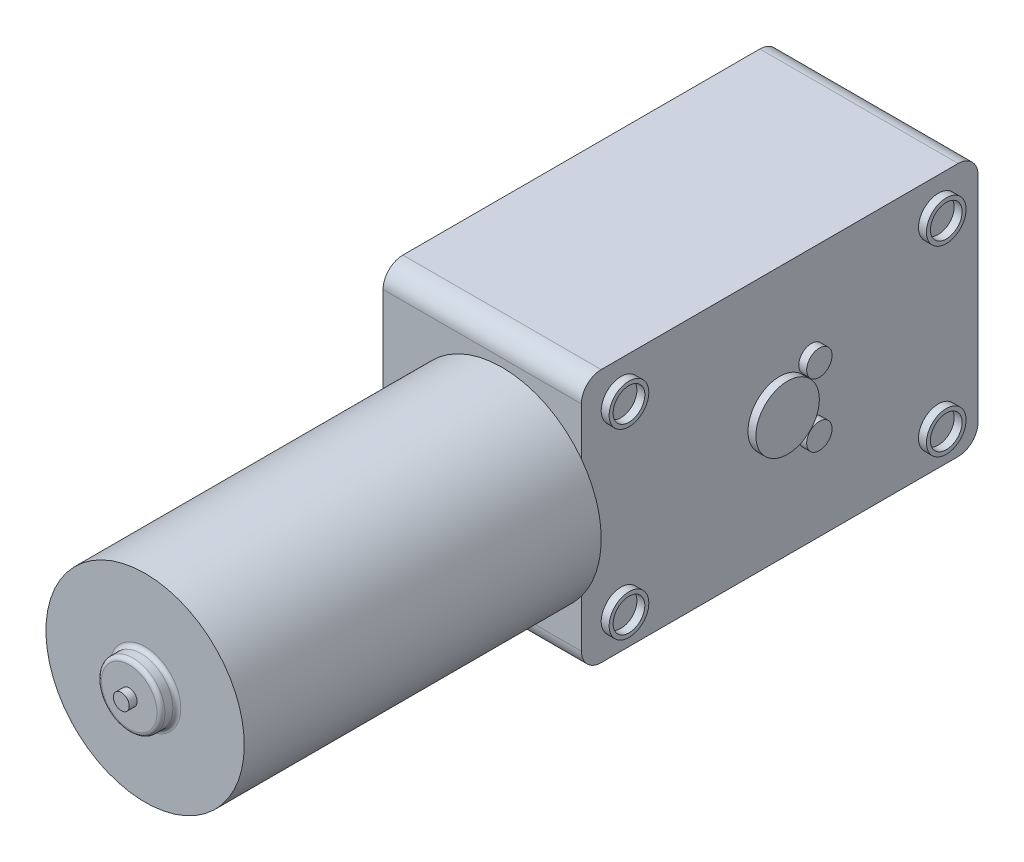
ISO-10303-21;
HEADER;
FILE_DESCRIPTION(('STEP AP214'),'2;1');
FILE_NAME('part.step','',(''),(''),'','','');
FILE_SCHEMA(('AUTOMOTIVE_DESIGN { 1 0 10303 214 1 1 1 1 }'));
ENDSEC;
DATA;
#1=APPLICATION_CONTEXT('core data for automotive mechanical design processes');
#2=APPLICATION_PROTOCOL_DEFINITION('international standard','automotive_design',2000,#1);
#3=PRODUCT_CONTEXT('',#1,'mechanical');
#4=PRODUCT('Part','Part','',(#3));
#5=PRODUCT_RELATED_PRODUCT_CATEGORY('part','',(#4));
#6=PRODUCT_DEFINITION_FORMATION('','',#4);
#7=PRODUCT_DEFINITION_CONTEXT('part definition',#1,'design');
#8=PRODUCT_DEFINITION('design','',#6,#7);
#9=PRODUCT_DEFINITION_SHAPE('','',#8);
#10=(LENGTH_UNIT() NAMED_UNIT(*) SI_UNIT(.MILLI.,.METRE.));
#11=(NAMED_UNIT(*) PLANE_ANGLE_UNIT() SI_UNIT($,.RADIAN.));
#12=(NAMED_UNIT(*) SI_UNIT($,.STERADIAN.) SOLID_ANGLE_UNIT());
#13=UNCERTAINTY_MEASURE_WITH_UNIT(LENGTH_MEASURE(1.E-05),#10,'distance_accuracy_value','');
#14=(GEOMETRIC_REPRESENTATION_CONTEXT(3) GLOBAL_UNCERTAINTY_ASSIGNED_CONTEXT((#13)) GLOBAL_UNIT_ASSIGNED_CONTEXT((#10,
#11,#12)) REPRESENTATION_CONTEXT('',''));
#15=CARTESIAN_POINT('',(0.,0.,0.));
#16=DIRECTION('',(0.,0.,1.));
#17=DIRECTION('',(1.,0.,0.));
#18=AXIS2_PLACEMENT_3D('',#15,#16,#17);
#19=CARTESIAN_POINT('',(108.969208633094,23.3,53.));
#20=DIRECTION('',(0.,0.,-1.));
#21=DIRECTION('',(-1.,0.,0.));
#22=AXIS2_PLACEMENT_3D('',#19,#20,#21);
#23=PLANE('',#22);
#24=CARTESIAN_POINT('',(98.9692086330936,7.29999999999999,53.));
#25=DIRECTION('',(0.,0.,1.));
#26=DIRECTION('',(1.,0.,0.));
#27=AXIS2_PLACEMENT_3D('',#24,#25,#26);
#28=CIRCLE('',#27,12.5);
#29=CARTESIAN_POINT('',(108.969208633094,14.8,53.));
#30=VERTEX_POINT('',#29);
#31=CARTESIAN_POINT('',(108.969208633094,-0.200000000000002,53.));
#32=VERTEX_POINT('',#31);
#33=EDGE_CURVE('E60',#30,#32,#28,.T.);
#34=ORIENTED_EDGE('',*,*,#33,.F.);
#35=DIRECTION('',(0.,-1.,0.));
#36=VECTOR('',#35,1.);
#37=CARTESIAN_POINT('',(108.969208633094,23.3,53.));
#38=LINE('',#37,#36);
#39=CARTESIAN_POINT('',(108.969208633094,20.8,53.));
#40=VERTEX_POINT('',#39);
#41=EDGE_CURVE('E125',#40,#30,#38,.T.);
#42=ORIENTED_EDGE('',*,*,#41,.F.);
#43=DIRECTION('',(-1.,0.,0.));
#44=VECTOR('',#43,1.);
#45=CARTESIAN_POINT('',(108.969208633094,20.8,53.));
#46=LINE('',#45,#44);
#47=CARTESIAN_POINT('',(83.9692086330936,20.8,53.));
#48=VERTEX_POINT('',#47);
#49=EDGE_CURVE('E173',#40,#48,#46,.T.);
#50=ORIENTED_EDGE('',*,*,#49,.T.);
#51=DIRECTION('',(0.,-1.,0.));
#52=VECTOR('',#51,1.);
#53=CARTESIAN_POINT('',(83.9692086330936,23.3,53.));
#54=LINE('',#53,#52);
#55=CARTESIAN_POINT('',(83.9692086330936,-6.20000000000001,53.));
#56=VERTEX_POINT('',#55);
#57=EDGE_CURVE('E309',#48,#56,#54,.T.);
#58=ORIENTED_EDGE('',*,*,#57,.T.);
#59=DIRECTION('',(-1.,0.,0.));
#60=VECTOR('',#59,1.);
#61=CARTESIAN_POINT('',(108.969208633094,-6.20000000000001,53.));
#62=LINE('',#61,#60);
#63=CARTESIAN_POINT('',(108.969208633094,-6.20000000000001,53.));
#64=VERTEX_POINT('',#63);
#65=EDGE_CURVE('E171',#56,#64,#62,.F.);
#66=ORIENTED_EDGE('',*,*,#65,.T.);
#67=EDGE_CURVE('E126',#32,#64,#38,.T.);
#68=ORIENTED_EDGE('',*,*,#67,.F.);
#69=EDGE_LOOP('',(#34,#42,#50,#58,#66,#68));
#70=FACE_BOUND('',#69,.T.);
#71=ADVANCED_FACE('F46',(#70),#23,.F.);
#72=CARTESIAN_POINT('',(108.969208633094,-8.70000000000001,53.));
#73=DIRECTION('',(0.,1.,0.));
#74=DIRECTION('',(0.,0.,1.));
#75=AXIS2_PLACEMENT_3D('',#72,#73,#74);
#76=PLANE('',#75);
#77=DIRECTION('',(0.,0.,-1.));
#78=VECTOR('',#77,1.);
#79=CARTESIAN_POINT('',(83.9692086330936,-8.70000000000001,53.));
#80=LINE('',#79,#78);
#81=CARTESIAN_POINT('',(83.9692086330936,-8.70000000000001,50.5));
#82=VERTEX_POINT('',#81);
#83=CARTESIAN_POINT('',(83.9692086330936,-8.70000000000001,5.50000000000001));
#84=VERTEX_POINT('',#83);
#85=EDGE_CURVE('E154',#82,#84,#80,.T.);
#86=ORIENTED_EDGE('',*,*,#85,.T.);
#87=DIRECTION('',(-1.,0.,0.));
#88=VECTOR('',#87,1.);
#89=CARTESIAN_POINT('',(108.969208633094,-8.70000000000001,5.50000000000001));
#90=LINE('',#89,#88);
#91=CARTESIAN_POINT('',(108.969208633094,-8.70000000000001,5.50000000000001));
#92=VERTEX_POINT('',#91);
#93=EDGE_CURVE('E201',#84,#92,#90,.F.);
#94=ORIENTED_EDGE('',*,*,#93,.T.);
#95=DIRECTION('',(0.,0.,-1.));
#96=VECTOR('',#95,1.);
#97=CARTESIAN_POINT('',(108.969208633094,-8.70000000000001,53.));
#98=LINE('',#97,#96);
#99=CARTESIAN_POINT('',(108.969208633094,-8.70000000000001,50.5));
#100=VERTEX_POINT('',#99);
#101=EDGE_CURVE('E141',#100,#92,#98,.T.);
#102=ORIENTED_EDGE('',*,*,#101,.F.);
#103=DIRECTION('',(-1.,0.,0.));
#104=VECTOR('',#103,1.);
#105=CARTESIAN_POINT('',(108.969208633094,-8.70000000000001,50.5));
#106=LINE('',#105,#104);
#107=EDGE_CURVE('E198',#100,#82,#106,.T.);
#108=ORIENTED_EDGE('',*,*,#107,.T.);
#109=EDGE_LOOP('',(#86,#94,#102,#108));
#110=FACE_BOUND('',#109,.T.);
#111=ADVANCED_FACE('F342',(#110),#76,.F.);
#112=CARTESIAN_POINT('',(108.969208633094,23.3,3.));
#113=DIRECTION('',(0.,0.,1.));
#114=DIRECTION('',(0.,-1.,0.));
#115=AXIS2_PLACEMENT_3D('',#112,#113,#114);
#116=PLANE('',#115);
#117=DIRECTION('',(0.,1.,0.));
#118=VECTOR('',#117,1.);
#119=CARTESIAN_POINT('',(83.9692086330936,23.3,3.));
#120=LINE('',#119,#118);
#121=CARTESIAN_POINT('',(83.9692086330936,-6.20000000000001,3.));
#122=VERTEX_POINT('',#121);
#123=CARTESIAN_POINT('',(83.9692086330936,20.8,3.));
#124=VERTEX_POINT('',#123);
#125=EDGE_CURVE('E148',#122,#124,#120,.T.);
#126=ORIENTED_EDGE('',*,*,#125,.T.);
#127=DIRECTION('',(-1.,0.,0.));
#128=VECTOR('',#127,1.);
#129=CARTESIAN_POINT('',(108.969208633094,20.8,3.));
#130=LINE('',#129,#128);
#131=CARTESIAN_POINT('',(108.969208633094,20.8,3.));
#132=VERTEX_POINT('',#131);
#133=EDGE_CURVE('E68',#124,#132,#130,.F.);
#134=ORIENTED_EDGE('',*,*,#133,.T.);
#135=DIRECTION('',(0.,1.,0.));
#136=VECTOR('',#135,1.);
#137=CARTESIAN_POINT('',(108.969208633094,23.3,3.));
#138=LINE('',#137,#136);
#139=CARTESIAN_POINT('',(108.969208633094,-6.20000000000001,3.));
#140=VERTEX_POINT('',#139);
#141=EDGE_CURVE('E143',#140,#132,#138,.T.);
#142=ORIENTED_EDGE('',*,*,#141,.F.);
#143=DIRECTION('',(-1.,0.,0.));
#144=VECTOR('',#143,1.);
#145=CARTESIAN_POINT('',(108.969208633094,-6.20000000000001,3.));
#146=LINE('',#145,#144);
#147=EDGE_CURVE('E194',#140,#122,#146,.T.);
#148=ORIENTED_EDGE('',*,*,#147,.T.);
#149=EDGE_LOOP('',(#126,#134,#142,#148));
#150=FACE_BOUND('',#149,.T.);
#151=ADVANCED_FACE('F337',(#150),#116,.F.);
#152=CARTESIAN_POINT('',(108.969208633094,23.3,53.));
#153=DIRECTION('',(0.,-1.,0.));
#154=DIRECTION('',(0.,0.,-1.));
#155=AXIS2_PLACEMENT_3D('',#152,#153,#154);
#156=PLANE('',#155);
#157=DIRECTION('',(0.,0.,1.));
#158=VECTOR('',#157,1.);
#159=CARTESIAN_POINT('',(83.9692086330936,23.3,53.));
#160=LINE('',#159,#158);
#161=CARTESIAN_POINT('',(83.9692086330936,23.3,5.50000000000001));
#162=VERTEX_POINT('',#161);
#163=CARTESIAN_POINT('',(83.9692086330936,23.3,50.5));
#164=VERTEX_POINT('',#163);
#165=EDGE_CURVE('E146',#162,#164,#160,.T.);
#166=ORIENTED_EDGE('',*,*,#165,.T.);
#167=DIRECTION('',(-1.,0.,0.));
#168=VECTOR('',#167,1.);
#169=CARTESIAN_POINT('',(108.969208633094,23.3,50.5));
#170=LINE('',#169,#168);
#171=CARTESIAN_POINT('',(108.969208633094,23.3,50.5));
#172=VERTEX_POINT('',#171);
#173=EDGE_CURVE('E185',#164,#172,#170,.F.);
#174=ORIENTED_EDGE('',*,*,#173,.T.);
#175=DIRECTION('',(0.,0.,1.));
#176=VECTOR('',#175,1.);
#177=CARTESIAN_POINT('',(108.969208633094,23.3,53.));
#178=LINE('',#177,#176);
#179=CARTESIAN_POINT('',(108.969208633094,23.3,5.50000000000001));
#180=VERTEX_POINT('',#179);
#181=EDGE_CURVE('E162',#180,#172,#178,.T.);
#182=ORIENTED_EDGE('',*,*,#181,.F.);
#183=DIRECTION('',(-1.,0.,0.));
#184=VECTOR('',#183,1.);
#185=CARTESIAN_POINT('',(108.969208633094,23.3,5.50000000000001));
#186=LINE('',#185,#184);
#187=EDGE_CURVE('E183',#180,#162,#186,.T.);
#188=ORIENTED_EDGE('',*,*,#187,.T.);
#189=EDGE_LOOP('',(#166,#174,#182,#188));
#190=FACE_BOUND('',#189,.T.);
#191=ADVANCED_FACE('F335',(#190),#156,.F.);
#192=CARTESIAN_POINT('',(108.969208633094,0.,0.));
#193=DIRECTION('',(1.,0.,0.));
#194=DIRECTION('',(0.,0.,-1.));
#195=AXIS2_PLACEMENT_3D('',#192,#193,#194);
#196=PLANE('',#195);
#197=CARTESIAN_POINT('',(108.969208633094,3.29999999999999,24.));
#198=DIRECTION('',(1.,0.,0.));
#199=DIRECTION('',(0.,0.,-1.));
#200=AXIS2_PLACEMENT_3D('',#197,#198,#199);
#201=CIRCLE('',#200,1.6);
#202=CARTESIAN_POINT('',(108.969208633094,3.29999999999999,22.4));
#203=VERTEX_POINT('',#202);
#204=EDGE_CURVE('E233',#203,#203,#201,.T.);
#205=ORIENTED_EDGE('',*,*,#204,.F.);
#206=EDGE_LOOP('',(#205));
#207=FACE_BOUND('',#206,.T.);
#208=CARTESIAN_POINT('',(108.969208633094,11.3,24.));
#209=DIRECTION('',(1.,0.,0.));
#210=DIRECTION('',(0.,0.,-1.));
#211=AXIS2_PLACEMENT_3D('',#208,#209,#210);
#212=CIRCLE('',#211,1.6);
#213=CARTESIAN_POINT('',(108.969208633094,11.3,22.4));
#214=VERTEX_POINT('',#213);
#215=EDGE_CURVE('E238',#214,#214,#212,.T.);
#216=ORIENTED_EDGE('',*,*,#215,.F.);
#217=EDGE_LOOP('',(#216));
#218=FACE_BOUND('',#217,.T.);
#219=CARTESIAN_POINT('',(108.969208633094,7.29999999999999,28.));
#220=DIRECTION('',(1.,0.,0.));
#221=DIRECTION('',(0.,0.,-1.));
#222=AXIS2_PLACEMENT_3D('',#219,#220,#221);
#223=CIRCLE('',#222,4.);
#224=CARTESIAN_POINT('',(108.969208633094,7.29999999999999,24.));
#225=VERTEX_POINT('',#224);
#226=EDGE_CURVE('E244',#225,#225,#223,.T.);
#227=ORIENTED_EDGE('',*,*,#226,.F.);
#228=EDGE_LOOP('',(#227));
#229=FACE_BOUND('',#228,.T.);
#230=CARTESIAN_POINT('',(108.969208633094,-4.19999999999999,48.));
#231=DIRECTION('',(1.,0.,0.));
#232=DIRECTION('',(0.,0.,-1.));
#233=AXIS2_PLACEMENT_3D('',#230,#231,#232);
#234=CIRCLE('',#233,2.49999999999999);
#235=CARTESIAN_POINT('',(108.969208633094,-4.19999999999999,45.5));
#236=VERTEX_POINT('',#235);
#237=EDGE_CURVE('E255',#236,#236,#234,.T.);
#238=ORIENTED_EDGE('',*,*,#237,.F.);
#239=EDGE_LOOP('',(#238));
#240=FACE_BOUND('',#239,.T.);
#241=CARTESIAN_POINT('',(108.969208633094,18.8,8.00000000000001));
#242=DIRECTION('',(1.,0.,0.));
#243=DIRECTION('',(0.,0.,-1.));
#244=AXIS2_PLACEMENT_3D('',#241,#242,#243);
#245=CIRCLE('',#244,2.49999999999999);
#246=CARTESIAN_POINT('',(108.969208633094,18.8,5.50000000000002));
#247=VERTEX_POINT('',#246);
#248=EDGE_CURVE('E264',#247,#247,#245,.T.);
#249=ORIENTED_EDGE('',*,*,#248,.F.);
#250=EDGE_LOOP('',(#249));
#251=FACE_BOUND('',#250,.T.);
#252=CARTESIAN_POINT('',(108.969208633094,-4.19999999999999,8.00000000000001));
#253=DIRECTION('',(1.,0.,0.));
#254=DIRECTION('',(0.,0.,-1.));
#255=AXIS2_PLACEMENT_3D('',#252,#253,#254);
#256=CIRCLE('',#255,2.49999999999999);
#257=CARTESIAN_POINT('',(108.969208633094,-4.19999999999999,5.50000000000002));
#258=VERTEX_POINT('',#257);
#259=EDGE_CURVE('E273',#258,#258,#256,.T.);
#260=ORIENTED_EDGE('',*,*,#259,.F.);
#261=EDGE_LOOP('',(#260));
#262=FACE_BOUND('',#261,.T.);
#263=CARTESIAN_POINT('',(108.969208633094,18.8,48.));
#264=DIRECTION('',(1.,0.,0.));
#265=DIRECTION('',(0.,0.,-1.));
#266=AXIS2_PLACEMENT_3D('',#263,#264,#265);
#267=CIRCLE('',#266,2.49999999999999);
#268=CARTESIAN_POINT('',(108.969208633094,18.8,45.5));
#269=VERTEX_POINT('',#268);
#270=EDGE_CURVE('E282',#269,#269,#267,.T.);
#271=ORIENTED_EDGE('',*,*,#270,.F.);
#272=EDGE_LOOP('',(#271));
#273=FACE_BOUND('',#272,.T.);
#274=ORIENTED_EDGE('',*,*,#181,.T.);
#275=CARTESIAN_POINT('',(108.969208633094,20.8,50.5));
#276=DIRECTION('',(1.,0.,0.));
#277=DIRECTION('',(0.,0.,-1.));
#278=AXIS2_PLACEMENT_3D('',#275,#276,#277);
#279=CIRCLE('',#278,2.5);
#280=EDGE_CURVE('E140',#172,#40,#279,.T.);
#281=ORIENTED_EDGE('',*,*,#280,.T.);
#282=ORIENTED_EDGE('',*,*,#41,.T.);
#283=EDGE_CURVE('E119',#30,#32,#38,.T.);
#284=ORIENTED_EDGE('',*,*,#283,.T.);
#285=ORIENTED_EDGE('',*,*,#67,.T.);
#286=CARTESIAN_POINT('',(108.969208633094,-6.20000000000001,50.5));
#287=DIRECTION('',(1.,0.,0.));
#288=DIRECTION('',(0.,0.,-1.));
#289=AXIS2_PLACEMENT_3D('',#286,#287,#288);
#290=CIRCLE('',#289,2.5);
#291=EDGE_CURVE('E187',#64,#100,#290,.T.);
#292=ORIENTED_EDGE('',*,*,#291,.T.);
#293=ORIENTED_EDGE('',*,*,#101,.T.);
#294=CARTESIAN_POINT('',(108.969208633094,-6.20000000000001,5.5));
#295=DIRECTION('',(1.,0.,0.));
#296=DIRECTION('',(0.,0.,-1.));
#297=AXIS2_PLACEMENT_3D('',#294,#295,#296);
#298=CIRCLE('',#297,2.5);
#299=EDGE_CURVE('E189',#92,#140,#298,.T.);
#300=ORIENTED_EDGE('',*,*,#299,.T.);
#301=ORIENTED_EDGE('',*,*,#141,.T.);
#302=CARTESIAN_POINT('',(108.969208633094,20.8,5.50000000000001));
#303=DIRECTION('',(1.,0.,0.));
#304=DIRECTION('',(0.,0.,-1.));
#305=AXIS2_PLACEMENT_3D('',#302,#303,#304);
#306=CIRCLE('',#305,2.5);
#307=EDGE_CURVE('E191',#132,#180,#306,.T.);
#308=ORIENTED_EDGE('',*,*,#307,.T.);
#309=EDGE_LOOP('',(#274,#281,#282,#284,#285,#292,#293,#300,#301,#308));
#310=FACE_BOUND('',#309,.T.);
#311=ADVANCED_FACE('F138',(#207,#218,#229,#240,#251,#262,#273,#310),#196,.T.);
#312=CARTESIAN_POINT('',(83.9692086330936,0.,0.));
#313=DIRECTION('',(1.,0.,0.));
#314=DIRECTION('',(0.,0.,-1.));
#315=AXIS2_PLACEMENT_3D('',#312,#313,#314);
#316=PLANE('',#315);
#317=CARTESIAN_POINT('',(83.9692086330936,-4.20000000000001,8.00000000000001));
#318=DIRECTION('',(-1.,0.,0.));
#319=DIRECTION('',(0.,0.,1.));
#320=AXIS2_PLACEMENT_3D('',#317,#318,#319);
#321=CIRCLE('',#320,2.);
#322=CARTESIAN_POINT('',(83.9692086330936,-4.20000000000001,10.));
#323=VERTEX_POINT('',#322);
#324=EDGE_CURVE('E286',#323,#323,#321,.T.);
#325=ORIENTED_EDGE('',*,*,#324,.F.);
#326=EDGE_LOOP('',(#325));
#327=FACE_BOUND('',#326,.T.);
#328=CARTESIAN_POINT('',(83.9692086330936,-4.20000000000001,48.));
#329=DIRECTION('',(-1.,0.,0.));
#330=DIRECTION('',(0.,0.,1.));
#331=AXIS2_PLACEMENT_3D('',#328,#329,#330);
#332=CIRCLE('',#331,2.);
#333=CARTESIAN_POINT('',(83.9692086330936,-4.20000000000001,50.));
#334=VERTEX_POINT('',#333);
#335=EDGE_CURVE('E299',#334,#334,#332,.T.);
#336=ORIENTED_EDGE('',*,*,#335,.F.);
#337=EDGE_LOOP('',(#336));
#338=FACE_BOUND('',#337,.T.);
#339=CARTESIAN_POINT('',(83.9692086330936,18.8,48.));
#340=DIRECTION('',(-1.,0.,0.));
#341=DIRECTION('',(0.,0.,1.));
#342=AXIS2_PLACEMENT_3D('',#339,#340,#341);
#343=CIRCLE('',#342,2.);
#344=CARTESIAN_POINT('',(83.9692086330936,18.8,50.));
#345=VERTEX_POINT('',#344);
#346=EDGE_CURVE('E293',#345,#345,#343,.T.);
#347=ORIENTED_EDGE('',*,*,#346,.F.);
#348=EDGE_LOOP('',(#347));
#349=FACE_BOUND('',#348,.T.);
#350=CARTESIAN_POINT('',(83.9692086330936,18.8,8.00000000000001));
#351=DIRECTION('',(-1.,0.,0.));
#352=DIRECTION('',(0.,0.,1.));
#353=AXIS2_PLACEMENT_3D('',#350,#351,#352);
#354=CIRCLE('',#353,2.);
#355=CARTESIAN_POINT('',(83.9692086330936,18.8,10.));
#356=VERTEX_POINT('',#355);
#357=EDGE_CURVE('E292',#356,#356,#354,.T.);
#358=ORIENTED_EDGE('',*,*,#357,.F.);
#359=EDGE_LOOP('',(#358));
#360=FACE_BOUND('',#359,.T.);
#361=ORIENTED_EDGE('',*,*,#57,.F.);
#362=CARTESIAN_POINT('',(83.9692086330936,20.8,50.5));
#363=DIRECTION('',(1.,0.,0.));
#364=DIRECTION('',(0.,0.,-1.));
#365=AXIS2_PLACEMENT_3D('',#362,#363,#364);
#366=CIRCLE('',#365,2.5);
#367=EDGE_CURVE('E181',#48,#164,#366,.F.);
#368=ORIENTED_EDGE('',*,*,#367,.T.);
#369=ORIENTED_EDGE('',*,*,#165,.F.);
#370=CARTESIAN_POINT('',(83.9692086330936,20.8,5.50000000000001));
#371=DIRECTION('',(1.,0.,0.));
#372=DIRECTION('',(0.,0.,-1.));
#373=AXIS2_PLACEMENT_3D('',#370,#371,#372);
#374=CIRCLE('',#373,2.5);
#375=EDGE_CURVE('E179',#162,#124,#374,.F.);
#376=ORIENTED_EDGE('',*,*,#375,.T.);
#377=ORIENTED_EDGE('',*,*,#125,.F.);
#378=CARTESIAN_POINT('',(83.9692086330936,-6.20000000000001,5.5));
#379=DIRECTION('',(1.,0.,0.));
#380=DIRECTION('',(0.,0.,-1.));
#381=AXIS2_PLACEMENT_3D('',#378,#379,#380);
#382=CIRCLE('',#381,2.5);
#383=EDGE_CURVE('E177',#122,#84,#382,.F.);
#384=ORIENTED_EDGE('',*,*,#383,.T.);
#385=ORIENTED_EDGE('',*,*,#85,.F.);
#386=CARTESIAN_POINT('',(83.9692086330936,-6.20000000000001,50.5));
#387=DIRECTION('',(1.,0.,0.));
#388=DIRECTION('',(0.,0.,-1.));
#389=AXIS2_PLACEMENT_3D('',#386,#387,#388);
#390=CIRCLE('',#389,2.5);
#391=EDGE_CURVE('E175',#82,#56,#390,.F.);
#392=ORIENTED_EDGE('',*,*,#391,.T.);
#393=EDGE_LOOP('',(#361,#368,#369,#376,#377,#384,#385,#392));
#394=FACE_BOUND('',#393,.T.);
#395=ADVANCED_FACE('F315',(#327,#338,#349,#360,#394),#316,.F.);
#396=CARTESIAN_POINT('',(88.9692086330936,18.8,8.00000000000001));
#397=DIRECTION('',(-1.,0.,0.));
#398=DIRECTION('',(0.,0.,1.));
#399=AXIS2_PLACEMENT_3D('',#396,#397,#398);
#400=CYLINDRICAL_SURFACE('',#399,2.);
#401=CARTESIAN_POINT('',(88.9692086330936,18.8,8.00000000000001));
#402=DIRECTION('',(-1.,0.,0.));
#403=DIRECTION('',(0.,0.,1.));
#404=AXIS2_PLACEMENT_3D('',#401,#402,#403);
#405=CIRCLE('',#404,2.);
#406=CARTESIAN_POINT('',(88.9692086330936,18.8,10.));
#407=VERTEX_POINT('',#406);
#408=EDGE_CURVE('E307',#407,#407,#405,.T.);
#409=ORIENTED_EDGE('',*,*,#408,.F.);
#410=EDGE_LOOP('',(#409));
#411=FACE_BOUND('',#410,.T.);
#412=ORIENTED_EDGE('',*,*,#357,.T.);
#413=EDGE_LOOP('',(#412));
#414=FACE_BOUND('',#413,.T.);
#415=ADVANCED_FACE('F313',(#411,#414),#400,.F.);
#416=CARTESIAN_POINT('',(88.9692086330936,18.8,8.00000000000001));
#417=DIRECTION('',(-1.,0.,0.));
#418=DIRECTION('',(0.,0.,1.));
#419=AXIS2_PLACEMENT_3D('',#416,#417,#418);
#420=PLANE('',#419);
#421=ORIENTED_EDGE('',*,*,#408,.T.);
#422=EDGE_LOOP('',(#421));
#423=FACE_BOUND('',#422,.T.);
#424=ADVANCED_FACE('F566',(#423),#420,.T.);
#425=CARTESIAN_POINT('',(88.9692086330936,18.8,48.));
#426=DIRECTION('',(-1.,0.,0.));
#427=DIRECTION('',(0.,0.,1.));
#428=AXIS2_PLACEMENT_3D('',#425,#426,#427);
#429=CYLINDRICAL_SURFACE('',#428,2.);
#430=CARTESIAN_POINT('',(88.9692086330936,18.8,48.));
#431=DIRECTION('',(-1.,0.,0.));
#432=DIRECTION('',(0.,0.,1.));
#433=AXIS2_PLACEMENT_3D('',#430,#431,#432);
#434=CIRCLE('',#433,2.);
#435=CARTESIAN_POINT('',(88.9692086330936,18.8,50.));
#436=VERTEX_POINT('',#435);
#437=EDGE_CURVE('E289',#436,#436,#434,.T.);
#438=ORIENTED_EDGE('',*,*,#437,.F.);
#439=EDGE_LOOP('',(#438));
#440=FACE_BOUND('',#439,.T.);
#441=ORIENTED_EDGE('',*,*,#346,.T.);
#442=EDGE_LOOP('',(#441));
#443=FACE_BOUND('',#442,.T.);
#444=ADVANCED_FACE('F562',(#440,#443),#429,.F.);
#445=CARTESIAN_POINT('',(88.9692086330936,18.8,48.));
#446=DIRECTION('',(-1.,0.,0.));
#447=DIRECTION('',(0.,0.,1.));
#448=AXIS2_PLACEMENT_3D('',#445,#446,#447);
#449=PLANE('',#448);
#450=ORIENTED_EDGE('',*,*,#437,.T.);
#451=EDGE_LOOP('',(#450));
#452=FACE_BOUND('',#451,.T.);
#453=ADVANCED_FACE('F558',(#452),#449,.T.);
#454=CARTESIAN_POINT('',(88.9692086330936,-4.20000000000001,48.));
#455=DIRECTION('',(-1.,0.,0.));
#456=DIRECTION('',(0.,0.,1.));
#457=AXIS2_PLACEMENT_3D('',#454,#455,#456);
#458=CYLINDRICAL_SURFACE('',#457,2.);
#459=CARTESIAN_POINT('',(88.9692086330936,-4.20000000000001,48.));
#460=DIRECTION('',(-1.,0.,0.));
#461=DIRECTION('',(0.,0.,1.));
#462=AXIS2_PLACEMENT_3D('',#459,#460,#461);
#463=CIRCLE('',#462,2.);
#464=CARTESIAN_POINT('',(88.9692086330936,-4.20000000000001,50.));
#465=VERTEX_POINT('',#464);
#466=EDGE_CURVE('E296',#465,#465,#463,.T.);
#467=ORIENTED_EDGE('',*,*,#466,.F.);
#468=EDGE_LOOP('',(#467));
#469=FACE_BOUND('',#468,.T.);
#470=ORIENTED_EDGE('',*,*,#335,.T.);
#471=EDGE_LOOP('',(#470));
#472=FACE_BOUND('',#471,.T.);
#473=ADVANCED_FACE('F561',(#469,#472),#458,.F.);
#474=CARTESIAN_POINT('',(88.9692086330936,-4.20000000000001,48.));
#475=DIRECTION('',(-1.,0.,0.));
#476=DIRECTION('',(0.,0.,1.));
#477=AXIS2_PLACEMENT_3D('',#474,#475,#476);
#478=PLANE('',#477);
#479=ORIENTED_EDGE('',*,*,#466,.T.);
#480=EDGE_LOOP('',(#479));
#481=FACE_BOUND('',#480,.T.);
#482=ADVANCED_FACE('F568',(#481),#478,.T.);
#483=CARTESIAN_POINT('',(88.9692086330936,-4.20000000000001,8.00000000000001));
#484=DIRECTION('',(-1.,0.,0.));
#485=DIRECTION('',(0.,0.,1.));
#486=AXIS2_PLACEMENT_3D('',#483,#484,#485);
#487=CYLINDRICAL_SURFACE('',#486,2.);
#488=CARTESIAN_POINT('',(88.9692086330936,-4.20000000000001,8.00000000000001));
#489=DIRECTION('',(-1.,0.,0.));
#490=DIRECTION('',(0.,0.,1.));
#491=AXIS2_PLACEMENT_3D('',#488,#489,#490);
#492=CIRCLE('',#491,2.);
#493=CARTESIAN_POINT('',(88.9692086330936,-4.20000000000001,10.));
#494=VERTEX_POINT('',#493);
#495=EDGE_CURVE('E302',#494,#494,#492,.T.);
#496=ORIENTED_EDGE('',*,*,#495,.F.);
#497=EDGE_LOOP('',(#496));
#498=FACE_BOUND('',#497,.T.);
#499=ORIENTED_EDGE('',*,*,#324,.T.);
#500=EDGE_LOOP('',(#499));
#501=FACE_BOUND('',#500,.T.);
#502=ADVANCED_FACE('F571',(#498,#501),#487,.F.);
#503=CARTESIAN_POINT('',(88.9692086330936,-4.20000000000001,8.00000000000001));
#504=DIRECTION('',(-1.,0.,0.));
#505=DIRECTION('',(0.,0.,1.));
#506=AXIS2_PLACEMENT_3D('',#503,#504,#505);
#507=PLANE('',#506);
#508=ORIENTED_EDGE('',*,*,#495,.T.);
#509=EDGE_LOOP('',(#508));
#510=FACE_BOUND('',#509,.T.);
#511=ADVANCED_FACE('F553',(#510),#507,.T.);
#512=CARTESIAN_POINT('',(109.969208633094,18.8,48.));
#513=DIRECTION('',(1.,0.,0.));
#514=DIRECTION('',(0.,0.,-1.));
#515=AXIS2_PLACEMENT_3D('',#512,#513,#514);
#516=PLANE('',#515);
#517=CARTESIAN_POINT('',(109.969208633094,18.8,48.));
#518=DIRECTION('',(1.,0.,0.));
#519=DIRECTION('',(0.,0.,-1.));
#520=AXIS2_PLACEMENT_3D('',#517,#518,#519);
#521=CIRCLE('',#520,2.49999999999999);
#522=CARTESIAN_POINT('',(109.969208633094,18.8,45.5));
#523=VERTEX_POINT('',#522);
#524=EDGE_CURVE('E283',#523,#523,#521,.T.);
#525=ORIENTED_EDGE('',*,*,#524,.T.);
#526=EDGE_LOOP('',(#525));
#527=FACE_BOUND('',#526,.T.);
#528=CARTESIAN_POINT('',(109.969208633094,18.8,48.));
#529=DIRECTION('',(1.,0.,0.));
#530=DIRECTION('',(0.,0.,-1.));
#531=AXIS2_PLACEMENT_3D('',#528,#529,#530);
#532=CIRCLE('',#531,2.);
#533=CARTESIAN_POINT('',(109.969208633094,18.8,46.));
#534=VERTEX_POINT('',#533);
#535=EDGE_CURVE('E277',#534,#534,#532,.T.);
#536=ORIENTED_EDGE('',*,*,#535,.F.);
#537=EDGE_LOOP('',(#536));
#538=FACE_BOUND('',#537,.T.);
#539=ADVANCED_FACE('F550',(#527,#538),#516,.T.);
#540=CARTESIAN_POINT('',(109.969208633094,18.8,48.));
#541=DIRECTION('',(-1.,0.,0.));
#542=DIRECTION('',(0.,0.,1.));
#543=AXIS2_PLACEMENT_3D('',#540,#541,#542);
#544=CYLINDRICAL_SURFACE('',#543,2.49999999999999);
#545=ORIENTED_EDGE('',*,*,#524,.F.);
#546=EDGE_LOOP('',(#545));
#547=FACE_BOUND('',#546,.T.);
#548=ORIENTED_EDGE('',*,*,#270,.T.);
#549=EDGE_LOOP('',(#548));
#550=FACE_BOUND('',#549,.T.);
#551=ADVANCED_FACE('F548',(#547,#550),#544,.T.);
#552=CARTESIAN_POINT('',(109.969208633094,18.8,48.));
#553=DIRECTION('',(-1.,0.,0.));
#554=DIRECTION('',(0.,0.,1.));
#555=AXIS2_PLACEMENT_3D('',#552,#553,#554);
#556=CYLINDRICAL_SURFACE('',#555,2.);
#557=ORIENTED_EDGE('',*,*,#535,.T.);
#558=EDGE_LOOP('',(#557));
#559=FACE_BOUND('',#558,.T.);
#560=CARTESIAN_POINT('',(108.969208633094,18.8,48.));
#561=DIRECTION('',(1.,0.,0.));
#562=DIRECTION('',(0.,0.,-1.));
#563=AXIS2_PLACEMENT_3D('',#560,#561,#562);
#564=CIRCLE('',#563,2.);
#565=CARTESIAN_POINT('',(108.969208633094,18.8,46.));
#566=VERTEX_POINT('',#565);
#567=EDGE_CURVE('E158',#566,#566,#564,.F.);
#568=ORIENTED_EDGE('',*,*,#567,.T.);
#569=EDGE_LOOP('',(#568));
#570=FACE_BOUND('',#569,.T.);
#571=ADVANCED_FACE('F545',(#559,#570),#556,.F.);
#572=ORIENTED_EDGE('',*,*,#567,.F.);
#573=EDGE_LOOP('',(#572));
#574=FACE_BOUND('',#573,.T.);
#575=ADVANCED_FACE('F403',(#574),#196,.T.);
#576=CARTESIAN_POINT('',(109.969208633094,-4.19999999999999,8.00000000000001));
#577=DIRECTION('',(1.,0.,0.));
#578=DIRECTION('',(0.,0.,-1.));
#579=AXIS2_PLACEMENT_3D('',#576,#577,#578);
#580=PLANE('',#579);
#581=CARTESIAN_POINT('',(109.969208633094,-4.19999999999999,8.00000000000001));
#582=DIRECTION('',(1.,0.,0.));
#583=DIRECTION('',(0.,0.,-1.));
#584=AXIS2_PLACEMENT_3D('',#581,#582,#583);
#585=CIRCLE('',#584,2.49999999999999);
#586=CARTESIAN_POINT('',(109.969208633094,-4.19999999999999,5.50000000000002));
#587=VERTEX_POINT('',#586);
#588=EDGE_CURVE('E274',#587,#587,#585,.T.);
#589=ORIENTED_EDGE('',*,*,#588,.T.);
#590=EDGE_LOOP('',(#589));
#591=FACE_BOUND('',#590,.T.);
#592=CARTESIAN_POINT('',(109.969208633094,-4.19999999999999,8.00000000000001));
#593=DIRECTION('',(1.,0.,0.));
#594=DIRECTION('',(0.,0.,-1.));
#595=AXIS2_PLACEMENT_3D('',#592,#593,#594);
#596=CIRCLE('',#595,1.99999999999999);
#597=CARTESIAN_POINT('',(109.969208633094,-4.19999999999999,6.00000000000002));
#598=VERTEX_POINT('',#597);
#599=EDGE_CURVE('E268',#598,#598,#596,.T.);
#600=ORIENTED_EDGE('',*,*,#599,.F.);
#601=EDGE_LOOP('',(#600));
#602=FACE_BOUND('',#601,.T.);
#603=ADVANCED_FACE('F538',(#591,#602),#580,.T.);
#604=CARTESIAN_POINT('',(109.969208633094,-4.19999999999999,8.00000000000001));
#605=DIRECTION('',(-1.,0.,0.));
#606=DIRECTION('',(0.,0.,1.));
#607=AXIS2_PLACEMENT_3D('',#604,#605,#606);
#608=CYLINDRICAL_SURFACE('',#607,2.49999999999999);
#609=ORIENTED_EDGE('',*,*,#588,.F.);
#610=EDGE_LOOP('',(#609));
#611=FACE_BOUND('',#610,.T.);
#612=ORIENTED_EDGE('',*,*,#259,.T.);
#613=EDGE_LOOP('',(#612));
#614=FACE_BOUND('',#613,.T.);
#615=ADVANCED_FACE('F536',(#611,#614),#608,.T.);
#616=CARTESIAN_POINT('',(109.969208633094,-4.19999999999999,8.00000000000001));
#617=DIRECTION('',(-1.,0.,0.));
#618=DIRECTION('',(0.,0.,1.));
#619=AXIS2_PLACEMENT_3D('',#616,#617,#618);
#620=CYLINDRICAL_SURFACE('',#619,1.99999999999999);
#621=ORIENTED_EDGE('',*,*,#599,.T.);
#622=EDGE_LOOP('',(#621));
#623=FACE_BOUND('',#622,.T.);
#624=CARTESIAN_POINT('',(108.969208633094,-4.19999999999999,8.00000000000001));
#625=DIRECTION('',(1.,0.,0.));
#626=DIRECTION('',(0.,0.,-1.));
#627=AXIS2_PLACEMENT_3D('',#624,#625,#626);
#628=CIRCLE('',#627,1.99999999999999);
#629=CARTESIAN_POINT('',(108.969208633094,-4.19999999999999,6.00000000000002));
#630=VERTEX_POINT('',#629);
#631=EDGE_CURVE('E161',#630,#630,#628,.F.);
#632=ORIENTED_EDGE('',*,*,#631,.T.);
#633=EDGE_LOOP('',(#632));
#634=FACE_BOUND('',#633,.T.);
#635=ADVANCED_FACE('F533',(#623,#634),#620,.F.);
#636=ORIENTED_EDGE('',*,*,#631,.F.);
#637=EDGE_LOOP('',(#636));
#638=FACE_BOUND('',#637,.T.);
#639=ADVANCED_FACE('F528',(#638),#196,.T.);
#640=CARTESIAN_POINT('',(109.969208633094,18.8,8.00000000000001));
#641=DIRECTION('',(1.,0.,0.));
#642=DIRECTION('',(0.,0.,-1.));
#643=AXIS2_PLACEMENT_3D('',#640,#641,#642);
#644=PLANE('',#643);
#645=CARTESIAN_POINT('',(109.969208633094,18.8,8.00000000000001));
#646=DIRECTION('',(1.,0.,0.));
#647=DIRECTION('',(0.,0.,-1.));
#648=AXIS2_PLACEMENT_3D('',#645,#646,#647);
#649=CIRCLE('',#648,2.49999999999999);
#650=CARTESIAN_POINT('',(109.969208633094,18.8,5.50000000000002));
#651=VERTEX_POINT('',#650);
#652=EDGE_CURVE('E265',#651,#651,#649,.T.);
#653=ORIENTED_EDGE('',*,*,#652,.T.);
#654=EDGE_LOOP('',(#653));
#655=FACE_BOUND('',#654,.T.);
#656=CARTESIAN_POINT('',(109.969208633094,18.8,8.00000000000001));
#657=DIRECTION('',(1.,0.,0.));
#658=DIRECTION('',(0.,0.,-1.));
#659=AXIS2_PLACEMENT_3D('',#656,#657,#658);
#660=CIRCLE('',#659,1.99999999999999);
#661=CARTESIAN_POINT('',(109.969208633094,18.8,6.00000000000002));
#662=VERTEX_POINT('',#661);
#663=EDGE_CURVE('E259',#662,#662,#660,.T.);
#664=ORIENTED_EDGE('',*,*,#663,.F.);
#665=EDGE_LOOP('',(#664));
#666=FACE_BOUND('',#665,.T.);
#667=ADVANCED_FACE('F525',(#655,#666),#644,.T.);
#668=CARTESIAN_POINT('',(109.969208633094,18.8,8.00000000000001));
#669=DIRECTION('',(-1.,0.,0.));
#670=DIRECTION('',(0.,0.,1.));
#671=AXIS2_PLACEMENT_3D('',#668,#669,#670);
#672=CYLINDRICAL_SURFACE('',#671,2.49999999999999);
#673=ORIENTED_EDGE('',*,*,#652,.F.);
#674=EDGE_LOOP('',(#673));
#675=FACE_BOUND('',#674,.T.);
#676=ORIENTED_EDGE('',*,*,#248,.T.);
#677=EDGE_LOOP('',(#676));
#678=FACE_BOUND('',#677,.T.);
#679=ADVANCED_FACE('F523',(#675,#678),#672,.T.);
#680=CARTESIAN_POINT('',(109.969208633094,18.8,8.00000000000001));
#681=DIRECTION('',(-1.,0.,0.));
#682=DIRECTION('',(0.,0.,1.));
#683=AXIS2_PLACEMENT_3D('',#680,#681,#682);
#684=CYLINDRICAL_SURFACE('',#683,1.99999999999999);
#685=ORIENTED_EDGE('',*,*,#663,.T.);
#686=EDGE_LOOP('',(#685));
#687=FACE_BOUND('',#686,.T.);
#688=CARTESIAN_POINT('',(108.969208633094,18.8,8.00000000000001));
#689=DIRECTION('',(1.,0.,0.));
#690=DIRECTION('',(0.,0.,-1.));
#691=AXIS2_PLACEMENT_3D('',#688,#689,#690);
#692=CIRCLE('',#691,1.99999999999999);
#693=CARTESIAN_POINT('',(108.969208633094,18.8,6.00000000000002));
#694=VERTEX_POINT('',#693);
#695=EDGE_CURVE('E165',#694,#694,#692,.F.);
#696=ORIENTED_EDGE('',*,*,#695,.T.);
#697=EDGE_LOOP('',(#696));
#698=FACE_BOUND('',#697,.T.);
#699=ADVANCED_FACE('F520',(#687,#698),#684,.F.);
#700=ORIENTED_EDGE('',*,*,#695,.F.);
#701=EDGE_LOOP('',(#700));
#702=FACE_BOUND('',#701,.T.);
#703=ADVANCED_FACE('F515',(#702),#196,.T.);
#704=CARTESIAN_POINT('',(109.969208633094,-4.19999999999999,48.));
#705=DIRECTION('',(1.,0.,0.));
#706=DIRECTION('',(0.,0.,-1.));
#707=AXIS2_PLACEMENT_3D('',#704,#705,#706);
#708=PLANE('',#707);
#709=CARTESIAN_POINT('',(109.969208633094,-4.19999999999999,48.));
#710=DIRECTION('',(1.,0.,0.));
#711=DIRECTION('',(0.,0.,-1.));
#712=AXIS2_PLACEMENT_3D('',#709,#710,#711);
#713=CIRCLE('',#712,2.49999999999999);
#714=CARTESIAN_POINT('',(109.969208633094,-4.19999999999999,45.5));
#715=VERTEX_POINT('',#714);
#716=EDGE_CURVE('E256',#715,#715,#713,.T.);
#717=ORIENTED_EDGE('',*,*,#716,.T.);
#718=EDGE_LOOP('',(#717));
#719=FACE_BOUND('',#718,.T.);
#720=CARTESIAN_POINT('',(109.969208633094,-4.19999999999999,48.));
#721=DIRECTION('',(1.,0.,0.));
#722=DIRECTION('',(0.,0.,-1.));
#723=AXIS2_PLACEMENT_3D('',#720,#721,#722);
#724=CIRCLE('',#723,2.);
#725=CARTESIAN_POINT('',(109.969208633094,-4.19999999999999,46.));
#726=VERTEX_POINT('',#725);
#727=EDGE_CURVE('E250',#726,#726,#724,.T.);
#728=ORIENTED_EDGE('',*,*,#727,.F.);
#729=EDGE_LOOP('',(#728));
#730=FACE_BOUND('',#729,.T.);
#731=ADVANCED_FACE('F512',(#719,#730),#708,.T.);
#732=CARTESIAN_POINT('',(109.969208633094,-4.19999999999999,48.));
#733=DIRECTION('',(-1.,0.,0.));
#734=DIRECTION('',(0.,0.,1.));
#735=AXIS2_PLACEMENT_3D('',#732,#733,#734);
#736=CYLINDRICAL_SURFACE('',#735,2.49999999999999);
#737=ORIENTED_EDGE('',*,*,#716,.F.);
#738=EDGE_LOOP('',(#737));
#739=FACE_BOUND('',#738,.T.);
#740=ORIENTED_EDGE('',*,*,#237,.T.);
#741=EDGE_LOOP('',(#740));
#742=FACE_BOUND('',#741,.T.);
#743=ADVANCED_FACE('F510',(#739,#742),#736,.T.);
#744=CARTESIAN_POINT('',(109.969208633094,-4.19999999999999,48.));
#745=DIRECTION('',(-1.,0.,0.));
#746=DIRECTION('',(0.,0.,1.));
#747=AXIS2_PLACEMENT_3D('',#744,#745,#746);
#748=CYLINDRICAL_SURFACE('',#747,2.);
#749=ORIENTED_EDGE('',*,*,#727,.T.);
#750=EDGE_LOOP('',(#749));
#751=FACE_BOUND('',#750,.T.);
#752=CARTESIAN_POINT('',(108.969208633094,-4.19999999999999,48.));
#753=DIRECTION('',(1.,0.,0.));
#754=DIRECTION('',(0.,0.,-1.));
#755=AXIS2_PLACEMENT_3D('',#752,#753,#754);
#756=CIRCLE('',#755,2.);
#757=CARTESIAN_POINT('',(108.969208633094,-4.19999999999999,46.));
#758=VERTEX_POINT('',#757);
#759=EDGE_CURVE('E168',#758,#758,#756,.F.);
#760=ORIENTED_EDGE('',*,*,#759,.T.);
#761=EDGE_LOOP('',(#760));
#762=FACE_BOUND('',#761,.T.);
#763=ADVANCED_FACE('F507',(#751,#762),#748,.F.);
#764=ORIENTED_EDGE('',*,*,#759,.F.);
#765=EDGE_LOOP('',(#764));
#766=FACE_BOUND('',#765,.T.);
#767=ADVANCED_FACE('F402',(#766),#196,.T.);
#768=CARTESIAN_POINT('',(109.969208633094,7.29999999999999,28.));
#769=DIRECTION('',(-1.,0.,0.));
#770=DIRECTION('',(0.,0.,1.));
#771=AXIS2_PLACEMENT_3D('',#768,#769,#770);
#772=CYLINDRICAL_SURFACE('',#771,4.);
#773=CARTESIAN_POINT('',(109.969208633094,7.29999999999999,28.));
#774=DIRECTION('',(1.,0.,0.));
#775=DIRECTION('',(0.,0.,-1.));
#776=AXIS2_PLACEMENT_3D('',#773,#774,#775);
#777=CIRCLE('',#776,4.);
#778=CARTESIAN_POINT('',(109.969208633094,7.29999999999999,24.));
#779=VERTEX_POINT('',#778);
#780=EDGE_CURVE('E247',#779,#779,#777,.T.);
#781=ORIENTED_EDGE('',*,*,#780,.F.);
#782=EDGE_LOOP('',(#781));
#783=FACE_BOUND('',#782,.T.);
#784=ORIENTED_EDGE('',*,*,#226,.T.);
#785=EDGE_LOOP('',(#784));
#786=FACE_BOUND('',#785,.T.);
#787=ADVANCED_FACE('F502',(#783,#786),#772,.T.);
#788=CARTESIAN_POINT('',(109.969208633094,7.29999999999999,28.));
#789=DIRECTION('',(1.,0.,0.));
#790=DIRECTION('',(0.,0.,-1.));
#791=AXIS2_PLACEMENT_3D('',#788,#789,#790);
#792=PLANE('',#791);
#793=ORIENTED_EDGE('',*,*,#780,.T.);
#794=EDGE_LOOP('',(#793));
#795=FACE_BOUND('',#794,.T.);
#796=ADVANCED_FACE('F498',(#795),#792,.T.);
#797=CARTESIAN_POINT('',(109.969208633094,11.3,24.));
#798=DIRECTION('',(-1.,0.,0.));
#799=DIRECTION('',(0.,0.,1.));
#800=AXIS2_PLACEMENT_3D('',#797,#798,#799);
#801=CYLINDRICAL_SURFACE('',#800,1.6);
#802=CARTESIAN_POINT('',(109.969208633094,11.3,24.));
#803=DIRECTION('',(1.,0.,0.));
#804=DIRECTION('',(0.,0.,-1.));
#805=AXIS2_PLACEMENT_3D('',#802,#803,#804);
#806=CIRCLE('',#805,1.6);
#807=CARTESIAN_POINT('',(109.969208633094,11.3,22.4));
#808=VERTEX_POINT('',#807);
#809=EDGE_CURVE('E241',#808,#808,#806,.T.);
#810=ORIENTED_EDGE('',*,*,#809,.F.);
#811=EDGE_LOOP('',(#810));
#812=FACE_BOUND('',#811,.T.);
#813=ORIENTED_EDGE('',*,*,#215,.T.);
#814=EDGE_LOOP('',(#813));
#815=FACE_BOUND('',#814,.T.);
#816=ADVANCED_FACE('F494',(#812,#815),#801,.T.);
#817=CARTESIAN_POINT('',(109.969208633094,11.3,24.));
#818=DIRECTION('',(1.,0.,0.));
#819=DIRECTION('',(0.,0.,-1.));
#820=AXIS2_PLACEMENT_3D('',#817,#818,#819);
#821=PLANE('',#820);
#822=ORIENTED_EDGE('',*,*,#809,.T.);
#823=EDGE_LOOP('',(#822));
#824=FACE_BOUND('',#823,.T.);
#825=ADVANCED_FACE('F490',(#824),#821,.T.);
#826=CARTESIAN_POINT('',(109.969208633094,3.29999999999999,24.));
#827=DIRECTION('',(-1.,0.,0.));
#828=DIRECTION('',(0.,0.,1.));
#829=AXIS2_PLACEMENT_3D('',#826,#827,#828);
#830=CYLINDRICAL_SURFACE('',#829,1.6);
#831=CARTESIAN_POINT('',(109.969208633094,3.29999999999999,24.));
#832=DIRECTION('',(1.,0.,0.));
#833=DIRECTION('',(0.,0.,-1.));
#834=AXIS2_PLACEMENT_3D('',#831,#832,#833);
#835=CIRCLE('',#834,1.6);
#836=CARTESIAN_POINT('',(109.969208633094,3.29999999999999,22.4));
#837=VERTEX_POINT('',#836);
#838=EDGE_CURVE('E235',#837,#837,#835,.T.);
#839=ORIENTED_EDGE('',*,*,#838,.F.);
#840=EDGE_LOOP('',(#839));
#841=FACE_BOUND('',#840,.T.);
#842=ORIENTED_EDGE('',*,*,#204,.T.);
#843=EDGE_LOOP('',(#842));
#844=FACE_BOUND('',#843,.T.);
#845=ADVANCED_FACE('F486',(#841,#844),#830,.T.);
#846=CARTESIAN_POINT('',(109.969208633094,3.29999999999999,24.));
#847=DIRECTION('',(1.,0.,0.));
#848=DIRECTION('',(0.,0.,-1.));
#849=AXIS2_PLACEMENT_3D('',#846,#847,#848);
#850=PLANE('',#849);
#851=ORIENTED_EDGE('',*,*,#838,.T.);
#852=EDGE_LOOP('',(#851));
#853=FACE_BOUND('',#852,.T.);
#854=ADVANCED_FACE('F369',(#853),#850,.T.);
#855=CARTESIAN_POINT('',(108.969208633094,20.8,50.5));
#856=DIRECTION('',(-1.,0.,0.));
#857=DIRECTION('',(0.,0.,1.));
#858=AXIS2_PLACEMENT_3D('',#855,#856,#857);
#859=CYLINDRICAL_SURFACE('',#858,2.5);
#860=ORIENTED_EDGE('',*,*,#280,.F.);
#861=ORIENTED_EDGE('',*,*,#173,.F.);
#862=ORIENTED_EDGE('',*,*,#367,.F.);
#863=ORIENTED_EDGE('',*,*,#49,.F.);
#864=EDGE_LOOP('',(#860,#861,#862,#863));
#865=FACE_BOUND('',#864,.T.);
#866=ADVANCED_FACE('F366',(#865),#859,.T.);
#867=CARTESIAN_POINT('',(108.969208633094,20.8,5.50000000000001));
#868=DIRECTION('',(-1.,0.,0.));
#869=DIRECTION('',(0.,0.,1.));
#870=AXIS2_PLACEMENT_3D('',#867,#868,#869);
#871=CYLINDRICAL_SURFACE('',#870,2.5);
#872=ORIENTED_EDGE('',*,*,#307,.F.);
#873=ORIENTED_EDGE('',*,*,#133,.F.);
#874=ORIENTED_EDGE('',*,*,#375,.F.);
#875=ORIENTED_EDGE('',*,*,#187,.F.);
#876=EDGE_LOOP('',(#872,#873,#874,#875));
#877=FACE_BOUND('',#876,.T.);
#878=ADVANCED_FACE('F334',(#877),#871,.T.);
#879=CARTESIAN_POINT('',(108.969208633094,-6.20000000000001,5.5));
#880=DIRECTION('',(-1.,0.,0.));
#881=DIRECTION('',(0.,0.,1.));
#882=AXIS2_PLACEMENT_3D('',#879,#880,#881);
#883=CYLINDRICAL_SURFACE('',#882,2.5);
#884=ORIENTED_EDGE('',*,*,#299,.F.);
#885=ORIENTED_EDGE('',*,*,#93,.F.);
#886=ORIENTED_EDGE('',*,*,#383,.F.);
#887=ORIENTED_EDGE('',*,*,#147,.F.);
#888=EDGE_LOOP('',(#884,#885,#886,#887));
#889=FACE_BOUND('',#888,.T.);
#890=ADVANCED_FACE('F339',(#889),#883,.T.);
#891=CARTESIAN_POINT('',(108.969208633094,-6.20000000000001,50.5));
#892=DIRECTION('',(-1.,0.,0.));
#893=DIRECTION('',(0.,0.,1.));
#894=AXIS2_PLACEMENT_3D('',#891,#892,#893);
#895=CYLINDRICAL_SURFACE('',#894,2.5);
#896=ORIENTED_EDGE('',*,*,#291,.F.);
#897=ORIENTED_EDGE('',*,*,#65,.F.);
#898=ORIENTED_EDGE('',*,*,#391,.F.);
#899=ORIENTED_EDGE('',*,*,#107,.F.);
#900=EDGE_LOOP('',(#896,#897,#898,#899));
#901=FACE_BOUND('',#900,.T.);
#902=ADVANCED_FACE('F347',(#901),#895,.T.);
#903=CARTESIAN_POINT('',(98.9692086330936,7.29999999999999,98.));
#904=DIRECTION('',(0.,0.,-1.));
#905=DIRECTION('',(-1.,0.,0.));
#906=AXIS2_PLACEMENT_3D('',#903,#904,#905);
#907=CYLINDRICAL_SURFACE('',#906,12.5);
#908=CARTESIAN_POINT('',(98.9692086330936,7.29999999999999,98.));
#909=DIRECTION('',(0.,0.,1.));
#910=DIRECTION('',(1.,0.,0.));
#911=AXIS2_PLACEMENT_3D('',#908,#909,#910);
#912=CIRCLE('',#911,12.5);
#913=CARTESIAN_POINT('',(111.469208633094,7.29999999999999,98.));
#914=VERTEX_POINT('',#913);
#915=EDGE_CURVE('E136',#914,#914,#912,.T.);
#916=ORIENTED_EDGE('',*,*,#915,.F.);
#917=EDGE_LOOP('',(#916));
#918=FACE_BOUND('',#917,.T.);
#919=ORIENTED_EDGE('',*,*,#33,.T.);
#920=EDGE_CURVE('E121',#32,#30,#28,.T.);
#921=ORIENTED_EDGE('',*,*,#920,.T.);
#922=EDGE_LOOP('',(#919,#921));
#923=FACE_BOUND('',#922,.T.);
#924=ADVANCED_FACE('F128',(#918,#923),#907,.T.);
#925=CARTESIAN_POINT('',(98.9692086330936,7.29999999999999,98.));
#926=DIRECTION('',(0.,0.,1.));
#927=DIRECTION('',(1.,0.,0.));
#928=AXIS2_PLACEMENT_3D('',#925,#926,#927);
#929=PLANE('',#928);
#930=CARTESIAN_POINT('',(98.9692086330936,7.29999999999999,98.));
#931=DIRECTION('',(0.,0.,1.));
#932=DIRECTION('',(1.,0.,0.));
#933=AXIS2_PLACEMENT_3D('',#930,#931,#932);
#934=CIRCLE('',#933,4.50000000000001);
#935=CARTESIAN_POINT('',(103.469208633094,7.29999999999999,98.));
#936=VERTEX_POINT('',#935);
#937=EDGE_CURVE('E13',#936,#936,#934,.F.);
#938=ORIENTED_EDGE('',*,*,#937,.T.);
#939=EDGE_LOOP('',(#938));
#940=FACE_BOUND('',#939,.T.);
#941=ORIENTED_EDGE('',*,*,#915,.T.);
#942=EDGE_LOOP('',(#941));
#943=FACE_BOUND('',#942,.T.);
#944=ADVANCED_FACE('F354',(#940,#943),#929,.T.);
#945=CARTESIAN_POINT('',(98.9692086330936,7.29999999999999,53.));
#946=DIRECTION('',(0.,0.,1.));
#947=DIRECTION('',(1.,0.,0.));
#948=AXIS2_PLACEMENT_3D('',#945,#946,#947);
#949=PLANE('',#948);
#950=ORIENTED_EDGE('',*,*,#283,.F.);
#951=ORIENTED_EDGE('',*,*,#920,.F.);
#952=EDGE_LOOP('',(#950,#951));
#953=FACE_BOUND('',#952,.T.);
#954=ADVANCED_FACE('F120',(#953),#949,.F.);
#955=CARTESIAN_POINT('',(98.9692086330936,7.29999999999999,100.));
#956=DIRECTION('',(0.,0.,-1.));
#957=DIRECTION('',(-1.,0.,0.));
#958=AXIS2_PLACEMENT_3D('',#955,#956,#957);
#959=CYLINDRICAL_SURFACE('',#958,4.00000000000001);
#960=CARTESIAN_POINT('',(98.9692086330936,7.29999999999999,99.5));
#961=DIRECTION('',(0.,0.,1.));
#962=DIRECTION('',(1.,0.,0.));
#963=AXIS2_PLACEMENT_3D('',#960,#961,#962);
#964=CIRCLE('',#963,4.00000000000001);
#965=CARTESIAN_POINT('',(102.969208633094,7.29999999999999,99.5));
#966=VERTEX_POINT('',#965);
#967=EDGE_CURVE('E54',#966,#966,#964,.F.);
#968=ORIENTED_EDGE('',*,*,#967,.T.);
#969=EDGE_LOOP('',(#968));
#970=FACE_BOUND('',#969,.T.);
#971=CARTESIAN_POINT('',(98.9692086330936,7.29999999999999,98.5));
#972=DIRECTION('',(0.,0.,1.));
#973=DIRECTION('',(1.,0.,0.));
#974=AXIS2_PLACEMENT_3D('',#971,#972,#973);
#975=CIRCLE('',#974,4.00000000000001);
#976=CARTESIAN_POINT('',(102.969208633094,7.29999999999999,98.5));
#977=VERTEX_POINT('',#976);
#978=EDGE_CURVE('E207',#977,#977,#975,.T.);
#979=ORIENTED_EDGE('',*,*,#978,.T.);
#980=EDGE_LOOP('',(#979));
#981=FACE_BOUND('',#980,.T.);
#982=ADVANCED_FACE('F212',(#970,#981),#959,.T.);
#983=CARTESIAN_POINT('',(98.9692086330936,7.29999999999999,100.));
#984=DIRECTION('',(0.,0.,1.));
#985=DIRECTION('',(1.,0.,0.));
#986=AXIS2_PLACEMENT_3D('',#983,#984,#985);
#987=PLANE('',#986);
#988=CARTESIAN_POINT('',(98.9692086330936,7.29999999999999,100.));
#989=DIRECTION('',(0.,0.,1.));
#990=DIRECTION('',(1.,0.,0.));
#991=AXIS2_PLACEMENT_3D('',#988,#989,#990);
#992=CIRCLE('',#991,3.50000000000001);
#993=CARTESIAN_POINT('',(102.469208633094,7.29999999999999,100.));
#994=VERTEX_POINT('',#993);
#995=EDGE_CURVE('E204',#994,#994,#992,.T.);
#996=ORIENTED_EDGE('',*,*,#995,.T.);
#997=EDGE_LOOP('',(#996));
#998=FACE_BOUND('',#997,.T.);
#999=CARTESIAN_POINT('',(98.9692086330936,7.29999999999999,100.));
#1000=DIRECTION('',(0.,0.,1.));
#1001=DIRECTION('',(1.,0.,0.));
#1002=AXIS2_PLACEMENT_3D('',#999,#1000,#1001);
#1003=CIRCLE('',#1002,0.999999999999998);
#1004=CARTESIAN_POINT('',(99.9692086330936,7.29999999999999,100.));
#1005=VERTEX_POINT('',#1004);
#1006=EDGE_CURVE('E203',#1005,#1005,#1003,.T.);
#1007=ORIENTED_EDGE('',*,*,#1006,.F.);
#1008=EDGE_LOOP('',(#1007));
#1009=FACE_BOUND('',#1008,.T.);
#1010=ADVANCED_FACE('F221',(#998,#1009),#987,.T.);
#1011=CARTESIAN_POINT('',(98.9692086330936,7.29999999999999,101.));
#1012=DIRECTION('',(0.,0.,-1.));
#1013=DIRECTION('',(-1.,0.,0.));
#1014=AXIS2_PLACEMENT_3D('',#1011,#1012,#1013);
#1015=CYLINDRICAL_SURFACE('',#1014,0.999999999999998);
#1016=CARTESIAN_POINT('',(98.9692086330936,7.29999999999999,101.));
#1017=DIRECTION('',(0.,0.,1.));
#1018=DIRECTION('',(1.,0.,0.));
#1019=AXIS2_PLACEMENT_3D('',#1016,#1017,#1018);
#1020=CIRCLE('',#1019,0.999999999999998);
#1021=CARTESIAN_POINT('',(99.9692086330936,7.29999999999999,101.));
#1022=VERTEX_POINT('',#1021);
#1023=EDGE_CURVE('E129',#1022,#1022,#1020,.T.);
#1024=ORIENTED_EDGE('',*,*,#1023,.F.);
#1025=EDGE_LOOP('',(#1024));
#1026=FACE_BOUND('',#1025,.T.);
#1027=ORIENTED_EDGE('',*,*,#1006,.T.);
#1028=EDGE_LOOP('',(#1027));
#1029=FACE_BOUND('',#1028,.T.);
#1030=ADVANCED_FACE('F224',(#1026,#1029),#1015,.T.);
#1031=CARTESIAN_POINT('',(98.9692086330936,7.29999999999999,101.));
#1032=DIRECTION('',(0.,0.,1.));
#1033=DIRECTION('',(1.,0.,0.));
#1034=AXIS2_PLACEMENT_3D('',#1031,#1032,#1033);
#1035=PLANE('',#1034);
#1036=ORIENTED_EDGE('',*,*,#1023,.T.);
#1037=EDGE_LOOP('',(#1036));
#1038=FACE_BOUND('',#1037,.T.);
#1039=ADVANCED_FACE('F218',(#1038),#1035,.T.);
#1040=CARTESIAN_POINT('',(98.9692086330936,7.29999999999999,99.5));
#1041=DIRECTION('',(0.,0.,1.));
#1042=DIRECTION('',(1.,0.,0.));
#1043=AXIS2_PLACEMENT_3D('',#1040,#1041,#1042);
#1044=TOROIDAL_SURFACE('',#1043,3.50000000000001,0.5);
#1045=ORIENTED_EDGE('',*,*,#967,.F.);
#1046=EDGE_LOOP('',(#1045));
#1047=FACE_BOUND('',#1046,.T.);
#1048=ORIENTED_EDGE('',*,*,#995,.F.);
#1049=EDGE_LOOP('',(#1048));
#1050=FACE_BOUND('',#1049,.T.);
#1051=ADVANCED_FACE('F215',(#1047,#1050),#1044,.T.);
#1052=CARTESIAN_POINT('',(98.9692086330936,7.29999999999999,98.5));
#1053=DIRECTION('',(0.,0.,1.));
#1054=DIRECTION('',(1.,0.,0.));
#1055=AXIS2_PLACEMENT_3D('',#1052,#1053,#1054);
#1056=TOROIDAL_SURFACE('',#1055,4.50000000000001,0.5);
#1057=ORIENTED_EDGE('',*,*,#937,.F.);
#1058=EDGE_LOOP('',(#1057));
#1059=FACE_BOUND('',#1058,.T.);
#1060=ORIENTED_EDGE('',*,*,#978,.F.);
#1061=EDGE_LOOP('',(#1060));
#1062=FACE_BOUND('',#1061,.T.);
#1063=ADVANCED_FACE('F48',(#1059,#1062),#1056,.F.);
#1064=CLOSED_SHELL('',(#71,#111,#151,#191,#311,#395,#415,#424,#444,#453,#473,#482,#502,#511,
#539,#551,#571,#575,#603,#615,#635,#639,#667,#679,#699,#703,#731,#743,#763,#767,#787,#796,#816,
#825,#845,#854,#866,#878,#890,#902,#924,#944,#954,#982,#1010,#1030,#1039,#1051,#1063));
#1065=MANIFOLD_SOLID_BREP('B2',#1064);
#1066=ADVANCED_BREP_SHAPE_REPRESENTATION('',(#18,#1065),#14);
#1067=SHAPE_DEFINITION_REPRESENTATION(#9,#1066);
ENDSEC;
END-ISO-10303-21;
